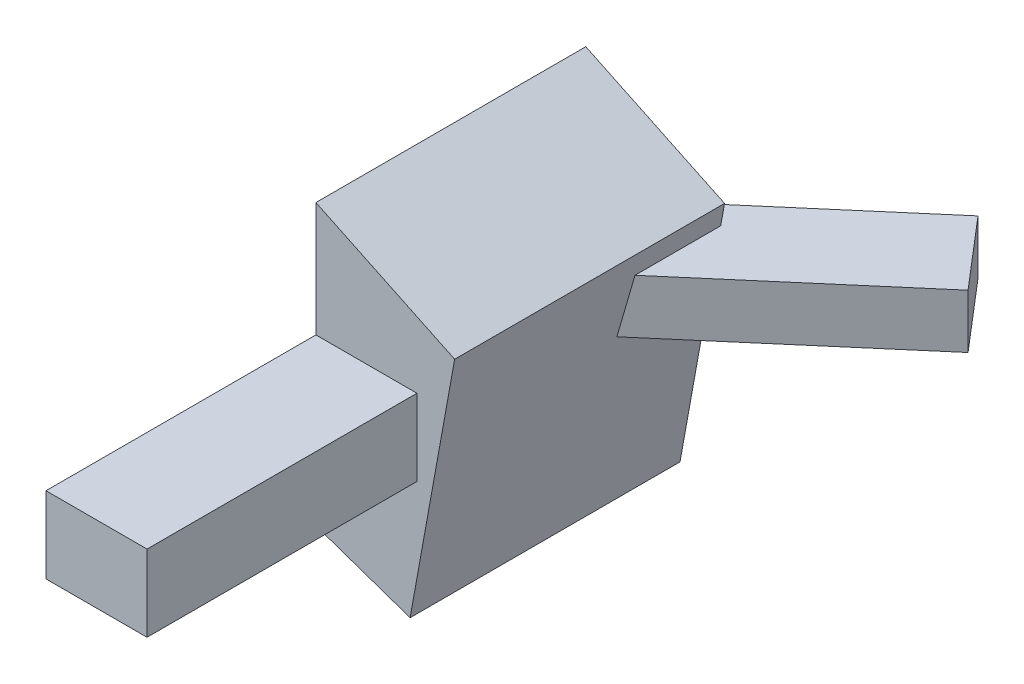
ISO-10303-21;
HEADER;
FILE_DESCRIPTION(('STEP AP214'),'2;1');
FILE_NAME('part.step','',(''),(''),'','','');
FILE_SCHEMA(('AUTOMOTIVE_DESIGN { 1 0 10303 214 1 1 1 1 }'));
ENDSEC;
DATA;
#1=APPLICATION_CONTEXT('core data for automotive mechanical design processes');
#2=APPLICATION_PROTOCOL_DEFINITION('international standard','automotive_design',2000,#1);
#3=PRODUCT_CONTEXT('',#1,'mechanical');
#4=PRODUCT('Part','Part','',(#3));
#5=PRODUCT_RELATED_PRODUCT_CATEGORY('part','',(#4));
#6=PRODUCT_DEFINITION_FORMATION('','',#4);
#7=PRODUCT_DEFINITION_CONTEXT('part definition',#1,'design');
#8=PRODUCT_DEFINITION('design','',#6,#7);
#9=PRODUCT_DEFINITION_SHAPE('','',#8);
#10=(LENGTH_UNIT() NAMED_UNIT(*) SI_UNIT(.MILLI.,.METRE.));
#11=(NAMED_UNIT(*) PLANE_ANGLE_UNIT() SI_UNIT($,.RADIAN.));
#12=(NAMED_UNIT(*) SI_UNIT($,.STERADIAN.) SOLID_ANGLE_UNIT());
#13=UNCERTAINTY_MEASURE_WITH_UNIT(LENGTH_MEASURE(1.E-05),#10,'distance_accuracy_value','');
#14=(GEOMETRIC_REPRESENTATION_CONTEXT(3) GLOBAL_UNCERTAINTY_ASSIGNED_CONTEXT((#13)) GLOBAL_UNIT_ASSIGNED_CONTEXT((#10,
#11,#12)) REPRESENTATION_CONTEXT('',''));
#15=CARTESIAN_POINT('',(0.,0.,0.));
#16=DIRECTION('',(0.,0.,1.));
#17=DIRECTION('',(1.,0.,0.));
#18=AXIS2_PLACEMENT_3D('',#15,#16,#17);
#19=CARTESIAN_POINT('',(174.54136862458,-60.305866535263,500.));
#20=DIRECTION('',(0.326567457034248,0.945173897230655,0.));
#21=DIRECTION('',(-0.945173897230655,0.326567457034248,0.));
#22=AXIS2_PLACEMENT_3D('',#19,#20,#21);
#23=PLANE('',#22);
#24=DIRECTION('',(0.945173897230655,-0.326567457034248,0.));
#25=VECTOR('',#24,1.);
#26=CARTESIAN_POINT('',(174.54136862458,-60.305866535263,0.));
#27=LINE('',#26,#25);
#28=CARTESIAN_POINT('',(0.,0.,0.));
#29=VERTEX_POINT('',#28);
#30=CARTESIAN_POINT('',(174.54136862458,-60.305866535263,0.));
#31=VERTEX_POINT('',#30);
#32=EDGE_CURVE('E203',#29,#31,#27,.T.);
#33=ORIENTED_EDGE('',*,*,#32,.T.);
#34=DIRECTION('',(0.,0.,-1.));
#35=VECTOR('',#34,1.);
#36=CARTESIAN_POINT('',(174.54136862458,-60.305866535263,500.));
#37=LINE('',#36,#35);
#38=CARTESIAN_POINT('',(174.54136862458,-60.305866535263,500.));
#39=VERTEX_POINT('',#38);
#40=EDGE_CURVE('E233',#39,#31,#37,.T.);
#41=ORIENTED_EDGE('',*,*,#40,.F.);
#42=DIRECTION('',(0.945173897230655,-0.326567457034248,0.));
#43=VECTOR('',#42,1.);
#44=CARTESIAN_POINT('',(174.54136862458,-60.305866535263,500.));
#45=LINE('',#44,#43);
#46=CARTESIAN_POINT('',(0.,0.,500.));
#47=VERTEX_POINT('',#46);
#48=EDGE_CURVE('E204',#47,#39,#45,.T.);
#49=ORIENTED_EDGE('',*,*,#48,.F.);
#50=DIRECTION('',(0.,0.,-1.));
#51=VECTOR('',#50,1.);
#52=CARTESIAN_POINT('',(0.,0.,500.));
#53=LINE('',#52,#51);
#54=EDGE_CURVE('E215',#47,#29,#53,.T.);
#55=ORIENTED_EDGE('',*,*,#54,.T.);
#56=EDGE_LOOP('',(#33,#41,#49,#55));
#57=FACE_BOUND('',#56,.T.);
#58=ADVANCED_FACE('F33',(#57),#23,.F.);
#59=CARTESIAN_POINT('',(257.068076210202,395.669035808319,500.));
#60=DIRECTION('',(-0.984013095437195,0.178096120137722,0.));
#61=DIRECTION('',(-0.178096120137722,-0.984013095437195,0.));
#62=AXIS2_PLACEMENT_3D('',#59,#60,#61);
#63=PLANE('',#62);
#64=DIRECTION('',(-0.176061652843831,-0.972772297727064,0.150719445237522));
#65=VECTOR('',#64,1.);
#66=CARTESIAN_POINT('',(247.850398927144,344.739710963794,160.524786513773));
#67=LINE('',#66,#65);
#68=CARTESIAN_POINT('',(249.921865683795,356.184937360257,158.75148542664));
#69=VERTEX_POINT('',#68);
#70=CARTESIAN_POINT('',(231.997079222685,257.147268280164,174.096188988045));
#71=VERTEX_POINT('',#70);
#72=EDGE_CURVE('E11',#69,#71,#67,.T.);
#73=ORIENTED_EDGE('',*,*,#72,.F.);
#74=DIRECTION('',(0.,0.,-1.));
#75=VECTOR('',#74,1.);
#76=CARTESIAN_POINT('',(249.921865683795,356.184937360257,500.));
#77=LINE('',#76,#75);
#78=CARTESIAN_POINT('',(249.921865683795,356.184937360257,0.));
#79=VERTEX_POINT('',#78);
#80=EDGE_CURVE('E135',#69,#79,#77,.T.);
#81=ORIENTED_EDGE('',*,*,#80,.T.);
#82=DIRECTION('',(0.178096120137722,0.984013095437195,0.));
#83=VECTOR('',#82,1.);
#84=CARTESIAN_POINT('',(257.068076210202,395.669035808319,0.));
#85=LINE('',#84,#83);
#86=CARTESIAN_POINT('',(257.068076210202,395.669035808319,0.));
#87=VERTEX_POINT('',#86);
#88=EDGE_CURVE('E218',#79,#87,#85,.T.);
#89=ORIENTED_EDGE('',*,*,#88,.T.);
#90=DIRECTION('',(0.,0.,-1.));
#91=VECTOR('',#90,1.);
#92=CARTESIAN_POINT('',(257.068076210202,395.669035808319,500.));
#93=LINE('',#92,#91);
#94=CARTESIAN_POINT('',(257.068076210202,395.669035808319,500.));
#95=VERTEX_POINT('',#94);
#96=EDGE_CURVE('E230',#95,#87,#93,.T.);
#97=ORIENTED_EDGE('',*,*,#96,.F.);
#98=DIRECTION('',(0.178096120137722,0.984013095437195,0.));
#99=VECTOR('',#98,1.);
#100=CARTESIAN_POINT('',(257.068076210202,395.669035808319,500.));
#101=LINE('',#100,#99);
#102=EDGE_CURVE('E207',#39,#95,#101,.T.);
#103=ORIENTED_EDGE('',*,*,#102,.F.);
#104=ORIENTED_EDGE('',*,*,#40,.T.);
#105=CARTESIAN_POINT('',(231.822907350462,256.184937360257,0.));
#106=VERTEX_POINT('',#105);
#107=EDGE_CURVE('E219',#31,#106,#85,.T.);
#108=ORIENTED_EDGE('',*,*,#107,.T.);
#109=DIRECTION('',(0.,0.,-1.));
#110=VECTOR('',#109,1.);
#111=CARTESIAN_POINT('',(231.822907350462,256.184937360257,500.));
#112=LINE('',#111,#110);
#113=CARTESIAN_POINT('',(231.822907350462,256.184937360257,173.892731579785));
#114=VERTEX_POINT('',#113);
#115=EDGE_CURVE('E166',#114,#106,#112,.T.);
#116=ORIENTED_EDGE('',*,*,#115,.F.);
#117=DIRECTION('',(-0.17436276817091,-0.963385654354379,-0.203680401757169));
#118=VECTOR('',#117,1.);
#119=CARTESIAN_POINT('',(267.60222696327,453.872113350451,215.688042985897));
#120=LINE('',#119,#118);
#121=EDGE_CURVE('E40',#71,#114,#120,.T.);
#122=ORIENTED_EDGE('',*,*,#121,.F.);
#123=EDGE_LOOP('',(#73,#81,#89,#97,#103,#104,#108,#116,#122));
#124=FACE_BOUND('',#123,.T.);
#125=ADVANCED_FACE('F261',(#124),#63,.F.);
#126=CARTESIAN_POINT('',(0.,518.568521205613,500.));
#127=DIRECTION('',(-0.431323773286295,-0.902197208263289,0.));
#128=DIRECTION('',(0.902197208263289,-0.431323773286295,0.));
#129=AXIS2_PLACEMENT_3D('',#126,#127,#128);
#130=PLANE('',#129);
#131=DIRECTION('',(-0.902197208263289,0.431323773286295,0.));
#132=VECTOR('',#131,1.);
#133=CARTESIAN_POINT('',(0.,518.568521205613,0.));
#134=LINE('',#133,#132);
#135=CARTESIAN_POINT('',(0.,518.568521205613,0.));
#136=VERTEX_POINT('',#135);
#137=EDGE_CURVE('E222',#87,#136,#134,.T.);
#138=ORIENTED_EDGE('',*,*,#137,.T.);
#139=DIRECTION('',(0.,0.,-1.));
#140=VECTOR('',#139,1.);
#141=CARTESIAN_POINT('',(0.,518.568521205613,500.));
#142=LINE('',#141,#140);
#143=CARTESIAN_POINT('',(0.,518.568521205613,500.));
#144=VERTEX_POINT('',#143);
#145=EDGE_CURVE('E227',#144,#136,#142,.T.);
#146=ORIENTED_EDGE('',*,*,#145,.F.);
#147=DIRECTION('',(-0.902197208263289,0.431323773286295,0.));
#148=VECTOR('',#147,1.);
#149=CARTESIAN_POINT('',(0.,518.568521205613,500.));
#150=LINE('',#149,#148);
#151=EDGE_CURVE('E210',#95,#144,#150,.T.);
#152=ORIENTED_EDGE('',*,*,#151,.F.);
#153=ORIENTED_EDGE('',*,*,#96,.T.);
#154=EDGE_LOOP('',(#138,#146,#152,#153));
#155=FACE_BOUND('',#154,.T.);
#156=ADVANCED_FACE('F264',(#155),#130,.F.);
#157=CARTESIAN_POINT('',(0.,0.,500.));
#158=DIRECTION('',(1.,0.,0.));
#159=DIRECTION('',(0.,0.,-1.));
#160=AXIS2_PLACEMENT_3D('',#157,#158,#159);
#161=PLANE('',#160);
#162=CARTESIAN_POINT('',(0.,238.758360313159,229.68304769715));
#163=DIRECTION('',(1.,0.,0.));
#164=DIRECTION('',(0.,0.,-1.));
#165=AXIS2_PLACEMENT_3D('',#162,#163,#164);
#166=CIRCLE('',#165,76.596772129887);
#167=CARTESIAN_POINT('',(0.,238.758360313159,153.086275567263));
#168=VERTEX_POINT('',#167);
#169=EDGE_CURVE('E236',#168,#168,#166,.F.);
#170=ORIENTED_EDGE('',*,*,#169,.F.);
#171=EDGE_LOOP('',(#170));
#172=FACE_BOUND('',#171,.T.);
#173=DIRECTION('',(0.,-1.,0.));
#174=VECTOR('',#173,1.);
#175=CARTESIAN_POINT('',(0.,0.,0.));
#176=LINE('',#175,#174);
#177=EDGE_CURVE('E208',#136,#29,#176,.T.);
#178=ORIENTED_EDGE('',*,*,#177,.T.);
#179=ORIENTED_EDGE('',*,*,#54,.F.);
#180=DIRECTION('',(0.,-1.,0.));
#181=VECTOR('',#180,1.);
#182=CARTESIAN_POINT('',(0.,0.,500.));
#183=LINE('',#182,#181);
#184=CARTESIAN_POINT('',(0.,164.603673619592,500.));
#185=VERTEX_POINT('',#184);
#186=EDGE_CURVE('E212',#185,#47,#183,.T.);
#187=ORIENTED_EDGE('',*,*,#186,.F.);
#188=DIRECTION('',(0.,0.,-1.));
#189=VECTOR('',#188,1.);
#190=CARTESIAN_POINT('',(0.,164.603673619592,1000.));
#191=LINE('',#190,#189);
#192=CARTESIAN_POINT('',(0.,164.603673619592,1000.));
#193=VERTEX_POINT('',#192);
#194=EDGE_CURVE('E200',#193,#185,#191,.T.);
#195=ORIENTED_EDGE('',*,*,#194,.F.);
#196=DIRECTION('',(0.,-1.,0.));
#197=VECTOR('',#196,1.);
#198=CARTESIAN_POINT('',(0.,164.603673619592,1000.));
#199=LINE('',#198,#197);
#200=CARTESIAN_POINT('',(0.,306.184937360257,1000.));
#201=VERTEX_POINT('',#200);
#202=EDGE_CURVE('E174',#201,#193,#199,.T.);
#203=ORIENTED_EDGE('',*,*,#202,.F.);
#204=DIRECTION('',(0.,0.,-1.));
#205=VECTOR('',#204,1.);
#206=CARTESIAN_POINT('',(0.,306.184937360257,1000.));
#207=LINE('',#206,#205);
#208=CARTESIAN_POINT('',(0.,306.184937360257,500.));
#209=VERTEX_POINT('',#208);
#210=EDGE_CURVE('E184',#201,#209,#207,.T.);
#211=ORIENTED_EDGE('',*,*,#210,.T.);
#212=EDGE_CURVE('E213',#144,#209,#183,.T.);
#213=ORIENTED_EDGE('',*,*,#212,.F.);
#214=ORIENTED_EDGE('',*,*,#145,.T.);
#215=EDGE_LOOP('',(#178,#179,#187,#195,#203,#211,#213,#214));
#216=FACE_BOUND('',#215,.T.);
#217=ADVANCED_FACE('F275',(#172,#216),#161,.F.);
#218=CARTESIAN_POINT('',(0.,0.,500.));
#219=DIRECTION('',(0.,0.,1.));
#220=DIRECTION('',(1.,0.,0.));
#221=AXIS2_PLACEMENT_3D('',#218,#219,#220);
#222=PLANE('',#221);
#223=DIRECTION('',(-1.,0.,0.));
#224=VECTOR('',#223,1.);
#225=CARTESIAN_POINT('',(0.,306.184937360257,500.));
#226=LINE('',#225,#224);
#227=CARTESIAN_POINT('',(187.178288099559,306.184937360257,500.));
#228=VERTEX_POINT('',#227);
#229=EDGE_CURVE('E178',#228,#209,#226,.T.);
#230=ORIENTED_EDGE('',*,*,#229,.F.);
#231=DIRECTION('',(0.,1.,0.));
#232=VECTOR('',#231,1.);
#233=CARTESIAN_POINT('',(187.178288099559,164.603673619592,500.));
#234=LINE('',#233,#232);
#235=CARTESIAN_POINT('',(187.178288099559,164.603673619592,500.));
#236=VERTEX_POINT('',#235);
#237=EDGE_CURVE('E187',#236,#228,#234,.T.);
#238=ORIENTED_EDGE('',*,*,#237,.F.);
#239=DIRECTION('',(1.,0.,0.));
#240=VECTOR('',#239,1.);
#241=CARTESIAN_POINT('',(0.,164.603673619592,500.));
#242=LINE('',#241,#240);
#243=EDGE_CURVE('E173',#185,#236,#242,.T.);
#244=ORIENTED_EDGE('',*,*,#243,.F.);
#245=ORIENTED_EDGE('',*,*,#186,.T.);
#246=ORIENTED_EDGE('',*,*,#48,.T.);
#247=ORIENTED_EDGE('',*,*,#102,.T.);
#248=ORIENTED_EDGE('',*,*,#151,.T.);
#249=ORIENTED_EDGE('',*,*,#212,.T.);
#250=EDGE_LOOP('',(#230,#238,#244,#245,#246,#247,#248,#249));
#251=FACE_BOUND('',#250,.T.);
#252=ADVANCED_FACE('F268',(#251),#222,.T.);
#253=CARTESIAN_POINT('',(0.,0.,0.));
#254=DIRECTION('',(0.,0.,1.));
#255=DIRECTION('',(1.,0.,0.));
#256=AXIS2_PLACEMENT_3D('',#253,#254,#255);
#257=PLANE('',#256);
#258=ORIENTED_EDGE('',*,*,#88,.F.);
#259=DIRECTION('',(-1.,0.,0.));
#260=VECTOR('',#259,1.);
#261=CARTESIAN_POINT('',(0.,356.184937360257,0.));
#262=LINE('',#261,#260);
#263=CARTESIAN_POINT('',(175.414296133966,356.184937360257,0.));
#264=VERTEX_POINT('',#263);
#265=EDGE_CURVE('E245',#79,#264,#262,.T.);
#266=ORIENTED_EDGE('',*,*,#265,.T.);
#267=DIRECTION('',(0.,1.,0.));
#268=VECTOR('',#267,1.);
#269=CARTESIAN_POINT('',(175.414296133966,0.,0.));
#270=LINE('',#269,#268);
#271=CARTESIAN_POINT('',(175.414296133966,256.184937360257,0.));
#272=VERTEX_POINT('',#271);
#273=EDGE_CURVE('E242',#272,#264,#270,.T.);
#274=ORIENTED_EDGE('',*,*,#273,.F.);
#275=DIRECTION('',(-1.,0.,0.));
#276=VECTOR('',#275,1.);
#277=CARTESIAN_POINT('',(0.,256.184937360257,0.));
#278=LINE('',#277,#276);
#279=EDGE_CURVE('E239',#106,#272,#278,.T.);
#280=ORIENTED_EDGE('',*,*,#279,.F.);
#281=ORIENTED_EDGE('',*,*,#107,.F.);
#282=ORIENTED_EDGE('',*,*,#32,.F.);
#283=ORIENTED_EDGE('',*,*,#177,.F.);
#284=ORIENTED_EDGE('',*,*,#137,.F.);
#285=EDGE_LOOP('',(#258,#266,#274,#280,#281,#282,#283,#284));
#286=FACE_BOUND('',#285,.T.);
#287=ADVANCED_FACE('F257',(#286),#257,.F.);
#288=CARTESIAN_POINT('',(0.,164.603673619592,1000.));
#289=DIRECTION('',(0.,1.,0.));
#290=DIRECTION('',(0.,0.,1.));
#291=AXIS2_PLACEMENT_3D('',#288,#289,#290);
#292=PLANE('',#291);
#293=ORIENTED_EDGE('',*,*,#243,.T.);
#294=DIRECTION('',(0.,0.,-1.));
#295=VECTOR('',#294,1.);
#296=CARTESIAN_POINT('',(187.178288099559,164.603673619592,1000.));
#297=LINE('',#296,#295);
#298=CARTESIAN_POINT('',(187.178288099559,164.603673619592,1000.));
#299=VERTEX_POINT('',#298);
#300=EDGE_CURVE('E197',#299,#236,#297,.T.);
#301=ORIENTED_EDGE('',*,*,#300,.F.);
#302=DIRECTION('',(1.,0.,0.));
#303=VECTOR('',#302,1.);
#304=CARTESIAN_POINT('',(0.,164.603673619592,1000.));
#305=LINE('',#304,#303);
#306=EDGE_CURVE('E177',#193,#299,#305,.T.);
#307=ORIENTED_EDGE('',*,*,#306,.F.);
#308=ORIENTED_EDGE('',*,*,#194,.T.);
#309=EDGE_LOOP('',(#293,#301,#307,#308));
#310=FACE_BOUND('',#309,.T.);
#311=ADVANCED_FACE('F289',(#310),#292,.F.);
#312=CARTESIAN_POINT('',(187.178288099559,164.603673619592,1000.));
#313=DIRECTION('',(-1.,0.,0.));
#314=DIRECTION('',(0.,0.,1.));
#315=AXIS2_PLACEMENT_3D('',#312,#313,#314);
#316=PLANE('',#315);
#317=ORIENTED_EDGE('',*,*,#237,.T.);
#318=DIRECTION('',(0.,0.,-1.));
#319=VECTOR('',#318,1.);
#320=CARTESIAN_POINT('',(187.178288099559,306.184937360257,1000.));
#321=LINE('',#320,#319);
#322=CARTESIAN_POINT('',(187.178288099559,306.184937360257,1000.));
#323=VERTEX_POINT('',#322);
#324=EDGE_CURVE('E194',#323,#228,#321,.T.);
#325=ORIENTED_EDGE('',*,*,#324,.F.);
#326=DIRECTION('',(0.,1.,0.));
#327=VECTOR('',#326,1.);
#328=CARTESIAN_POINT('',(187.178288099559,164.603673619592,1000.));
#329=LINE('',#328,#327);
#330=EDGE_CURVE('E180',#299,#323,#329,.T.);
#331=ORIENTED_EDGE('',*,*,#330,.F.);
#332=ORIENTED_EDGE('',*,*,#300,.T.);
#333=EDGE_LOOP('',(#317,#325,#331,#332));
#334=FACE_BOUND('',#333,.T.);
#335=ADVANCED_FACE('F285',(#334),#316,.F.);
#336=CARTESIAN_POINT('',(0.,306.184937360257,1000.));
#337=DIRECTION('',(0.,-1.,0.));
#338=DIRECTION('',(0.,0.,-1.));
#339=AXIS2_PLACEMENT_3D('',#336,#337,#338);
#340=PLANE('',#339);
#341=ORIENTED_EDGE('',*,*,#229,.T.);
#342=ORIENTED_EDGE('',*,*,#210,.F.);
#343=DIRECTION('',(-1.,0.,0.));
#344=VECTOR('',#343,1.);
#345=CARTESIAN_POINT('',(0.,306.184937360257,1000.));
#346=LINE('',#345,#344);
#347=EDGE_CURVE('E182',#323,#201,#346,.T.);
#348=ORIENTED_EDGE('',*,*,#347,.F.);
#349=ORIENTED_EDGE('',*,*,#324,.T.);
#350=EDGE_LOOP('',(#341,#342,#348,#349));
#351=FACE_BOUND('',#350,.T.);
#352=ADVANCED_FACE('F282',(#351),#340,.F.);
#353=CARTESIAN_POINT('',(0.,0.,1000.));
#354=DIRECTION('',(0.,0.,-1.));
#355=DIRECTION('',(-1.,0.,0.));
#356=AXIS2_PLACEMENT_3D('',#353,#354,#355);
#357=PLANE('',#356);
#358=ORIENTED_EDGE('',*,*,#202,.T.);
#359=ORIENTED_EDGE('',*,*,#306,.T.);
#360=ORIENTED_EDGE('',*,*,#330,.T.);
#361=ORIENTED_EDGE('',*,*,#347,.T.);
#362=EDGE_LOOP('',(#358,#359,#360,#361));
#363=FACE_BOUND('',#362,.T.);
#364=ADVANCED_FACE('F291',(#363),#357,.F.);
#365=CARTESIAN_POINT('',(-100.,238.758360313159,229.68304769715));
#366=DIRECTION('',(1.,0.,0.));
#367=DIRECTION('',(0.,0.,-1.));
#368=AXIS2_PLACEMENT_3D('',#365,#366,#367);
#369=CYLINDRICAL_SURFACE('',#368,76.596772129887);
#370=CARTESIAN_POINT('',(-100.,238.758360313159,229.68304769715));
#371=DIRECTION('',(-1.,0.,0.));
#372=DIRECTION('',(0.,0.,1.));
#373=AXIS2_PLACEMENT_3D('',#370,#371,#372);
#374=CIRCLE('',#373,76.596772129887);
#375=CARTESIAN_POINT('',(-100.,238.758360313159,306.279819827037));
#376=VERTEX_POINT('',#375);
#377=EDGE_CURVE('E170',#376,#376,#374,.T.);
#378=ORIENTED_EDGE('',*,*,#377,.F.);
#379=EDGE_LOOP('',(#378));
#380=FACE_BOUND('',#379,.T.);
#381=ORIENTED_EDGE('',*,*,#169,.T.);
#382=EDGE_LOOP('',(#381));
#383=FACE_BOUND('',#382,.T.);
#384=ADVANCED_FACE('F293',(#380,#383),#369,.T.);
#385=CARTESIAN_POINT('',(-100.,238.758360313159,229.68304769715));
#386=DIRECTION('',(-1.,0.,0.));
#387=DIRECTION('',(0.,0.,1.));
#388=AXIS2_PLACEMENT_3D('',#385,#386,#387);
#389=PLANE('',#388);
#390=ORIENTED_EDGE('',*,*,#377,.T.);
#391=EDGE_LOOP('',(#390));
#392=FACE_BOUND('',#391,.T.);
#393=ADVANCED_FACE('F299',(#392),#389,.T.);
#394=CARTESIAN_POINT('',(122.060196097274,356.184937360257,45.6743432132292));
#395=DIRECTION('',(0.759662691176321,0.,-0.650317303810032));
#396=DIRECTION('',(-0.650317303810032,0.,-0.759662691176321));
#397=AXIS2_PLACEMENT_3D('',#394,#395,#396);
#398=PLANE('',#397);
#399=DIRECTION('',(0.,-1.,0.));
#400=VECTOR('',#399,1.);
#401=CARTESIAN_POINT('',(231.997079222685,356.184937360257,174.096188988045));
#402=LINE('',#401,#400);
#403=CARTESIAN_POINT('',(231.997079222685,256.184937360257,174.096188988045));
#404=VERTEX_POINT('',#403);
#405=EDGE_CURVE('E146',#71,#404,#402,.T.);
#406=ORIENTED_EDGE('',*,*,#405,.F.);
#407=ORIENTED_EDGE('',*,*,#121,.T.);
#408=DIRECTION('',(0.650317303810032,0.,0.759662691176321));
#409=VECTOR('',#408,1.);
#410=CARTESIAN_POINT('',(122.060196097274,256.184937360257,45.6743432132292));
#411=LINE('',#410,#409);
#412=EDGE_CURVE('E159',#114,#404,#411,.T.);
#413=ORIENTED_EDGE('',*,*,#412,.T.);
#414=EDGE_LOOP('',(#406,#407,#413));
#415=FACE_BOUND('',#414,.T.);
#416=ADVANCED_FACE('F249',(#415),#398,.F.);
#417=CARTESIAN_POINT('',(582.306234847545,356.184937360257,-125.789679084752));
#418=DIRECTION('',(-0.650317303810033,0.,-0.75966269117632));
#419=DIRECTION('',(-0.75966269117632,0.,0.650317303810033));
#420=AXIS2_PLACEMENT_3D('',#417,#418,#419);
#421=PLANE('',#420);
#422=DIRECTION('',(0.759662691176321,0.,-0.650317303810033));
#423=VECTOR('',#422,1.);
#424=CARTESIAN_POINT('',(582.306234847545,356.184937360257,-125.789679084752));
#425=LINE('',#424,#423);
#426=CARTESIAN_POINT('',(582.306234847545,356.184937360257,-125.789679084752));
#427=VERTEX_POINT('',#426);
#428=EDGE_CURVE('E127',#69,#427,#425,.T.);
#429=ORIENTED_EDGE('',*,*,#428,.F.);
#430=ORIENTED_EDGE('',*,*,#72,.T.);
#431=ORIENTED_EDGE('',*,*,#405,.T.);
#432=DIRECTION('',(0.759662691176321,0.,-0.650317303810033));
#433=VECTOR('',#432,1.);
#434=CARTESIAN_POINT('',(582.306234847545,256.184937360257,-125.789679084752));
#435=LINE('',#434,#433);
#436=CARTESIAN_POINT('',(582.306234847545,256.184937360257,-125.789679084752));
#437=VERTEX_POINT('',#436);
#438=EDGE_CURVE('E143',#404,#437,#435,.T.);
#439=ORIENTED_EDGE('',*,*,#438,.T.);
#440=DIRECTION('',(0.,-1.,0.));
#441=VECTOR('',#440,1.);
#442=CARTESIAN_POINT('',(582.306234847545,356.184937360257,-125.789679084752));
#443=LINE('',#442,#441);
#444=EDGE_CURVE('E140',#427,#437,#443,.T.);
#445=ORIENTED_EDGE('',*,*,#444,.F.);
#446=EDGE_LOOP('',(#429,#430,#431,#439,#445));
#447=FACE_BOUND('',#446,.T.);
#448=ADVANCED_FACE('F141',(#447),#421,.F.);
#449=CARTESIAN_POINT('',(472.369351722135,356.184937360257,-254.211524859568));
#450=DIRECTION('',(0.650317303810033,0.,0.75966269117632));
#451=DIRECTION('',(0.75966269117632,0.,-0.650317303810033));
#452=AXIS2_PLACEMENT_3D('',#449,#450,#451);
#453=PLANE('',#452);
#454=DIRECTION('',(-0.75966269117632,0.,0.650317303810033));
#455=VECTOR('',#454,1.);
#456=CARTESIAN_POINT('',(472.369351722135,256.184937360257,-254.211524859568));
#457=LINE('',#456,#455);
#458=CARTESIAN_POINT('',(472.369351722135,256.184937360257,-254.211524859568));
#459=VERTEX_POINT('',#458);
#460=EDGE_CURVE('E156',#459,#272,#457,.T.);
#461=ORIENTED_EDGE('',*,*,#460,.T.);
#462=ORIENTED_EDGE('',*,*,#273,.T.);
#463=DIRECTION('',(-0.75966269117632,0.,0.650317303810033));
#464=VECTOR('',#463,1.);
#465=CARTESIAN_POINT('',(472.369351722135,356.184937360257,-254.211524859568));
#466=LINE('',#465,#464);
#467=CARTESIAN_POINT('',(472.369351722135,356.184937360257,-254.211524859568));
#468=VERTEX_POINT('',#467);
#469=EDGE_CURVE('E137',#468,#264,#466,.T.);
#470=ORIENTED_EDGE('',*,*,#469,.F.);
#471=DIRECTION('',(0.,-1.,0.));
#472=VECTOR('',#471,1.);
#473=CARTESIAN_POINT('',(472.369351722135,356.184937360257,-254.211524859568));
#474=LINE('',#473,#472);
#475=EDGE_CURVE('E147',#468,#459,#474,.T.);
#476=ORIENTED_EDGE('',*,*,#475,.T.);
#477=EDGE_LOOP('',(#461,#462,#470,#476));
#478=FACE_BOUND('',#477,.T.);
#479=ADVANCED_FACE('F254',(#478),#453,.F.);
#480=CARTESIAN_POINT('',(0.,356.184937360257,0.));
#481=DIRECTION('',(0.,1.,0.));
#482=DIRECTION('',(0.,0.,1.));
#483=AXIS2_PLACEMENT_3D('',#480,#481,#482);
#484=PLANE('',#483);
#485=ORIENTED_EDGE('',*,*,#80,.F.);
#486=ORIENTED_EDGE('',*,*,#428,.T.);
#487=DIRECTION('',(-0.650317303810032,0.,-0.759662691176321));
#488=VECTOR('',#487,1.);
#489=CARTESIAN_POINT('',(472.369351722135,356.184937360257,-254.211524859568));
#490=LINE('',#489,#488);
#491=EDGE_CURVE('E132',#427,#468,#490,.T.);
#492=ORIENTED_EDGE('',*,*,#491,.T.);
#493=ORIENTED_EDGE('',*,*,#469,.T.);
#494=ORIENTED_EDGE('',*,*,#265,.F.);
#495=EDGE_LOOP('',(#485,#486,#492,#493,#494));
#496=FACE_BOUND('',#495,.T.);
#497=ADVANCED_FACE('F129',(#496),#484,.T.);
#498=CARTESIAN_POINT('',(0.,256.184937360257,0.));
#499=DIRECTION('',(0.,1.,0.));
#500=DIRECTION('',(0.,0.,1.));
#501=AXIS2_PLACEMENT_3D('',#498,#499,#500);
#502=PLANE('',#501);
#503=ORIENTED_EDGE('',*,*,#412,.F.);
#504=ORIENTED_EDGE('',*,*,#115,.T.);
#505=ORIENTED_EDGE('',*,*,#279,.T.);
#506=ORIENTED_EDGE('',*,*,#460,.F.);
#507=DIRECTION('',(-0.650317303810032,0.,-0.759662691176321));
#508=VECTOR('',#507,1.);
#509=CARTESIAN_POINT('',(472.369351722135,256.184937360257,-254.211524859568));
#510=LINE('',#509,#508);
#511=EDGE_CURVE('E163',#437,#459,#510,.T.);
#512=ORIENTED_EDGE('',*,*,#511,.F.);
#513=ORIENTED_EDGE('',*,*,#438,.F.);
#514=EDGE_LOOP('',(#503,#504,#505,#506,#512,#513));
#515=FACE_BOUND('',#514,.T.);
#516=ADVANCED_FACE('F251',(#515),#502,.F.);
#517=CARTESIAN_POINT('',(472.369351722135,356.184937360257,-254.211524859568));
#518=DIRECTION('',(-0.759662691176321,0.,0.650317303810032));
#519=DIRECTION('',(0.650317303810032,0.,0.759662691176321));
#520=AXIS2_PLACEMENT_3D('',#517,#518,#519);
#521=PLANE('',#520);
#522=ORIENTED_EDGE('',*,*,#511,.T.);
#523=ORIENTED_EDGE('',*,*,#475,.F.);
#524=ORIENTED_EDGE('',*,*,#491,.F.);
#525=ORIENTED_EDGE('',*,*,#444,.T.);
#526=EDGE_LOOP('',(#522,#523,#524,#525));
#527=FACE_BOUND('',#526,.T.);
#528=ADVANCED_FACE('F149',(#527),#521,.F.);
#529=CLOSED_SHELL('',(#58,#125,#156,#217,#252,#287,#311,#335,#352,#364,#384,#393,#416,#448,#479,
#497,#516,#528));
#530=MANIFOLD_SOLID_BREP('B2',#529);
#531=ADVANCED_BREP_SHAPE_REPRESENTATION('',(#18,#530),#14);
#532=SHAPE_DEFINITION_REPRESENTATION(#9,#531);
ENDSEC;
END-ISO-10303-21;
